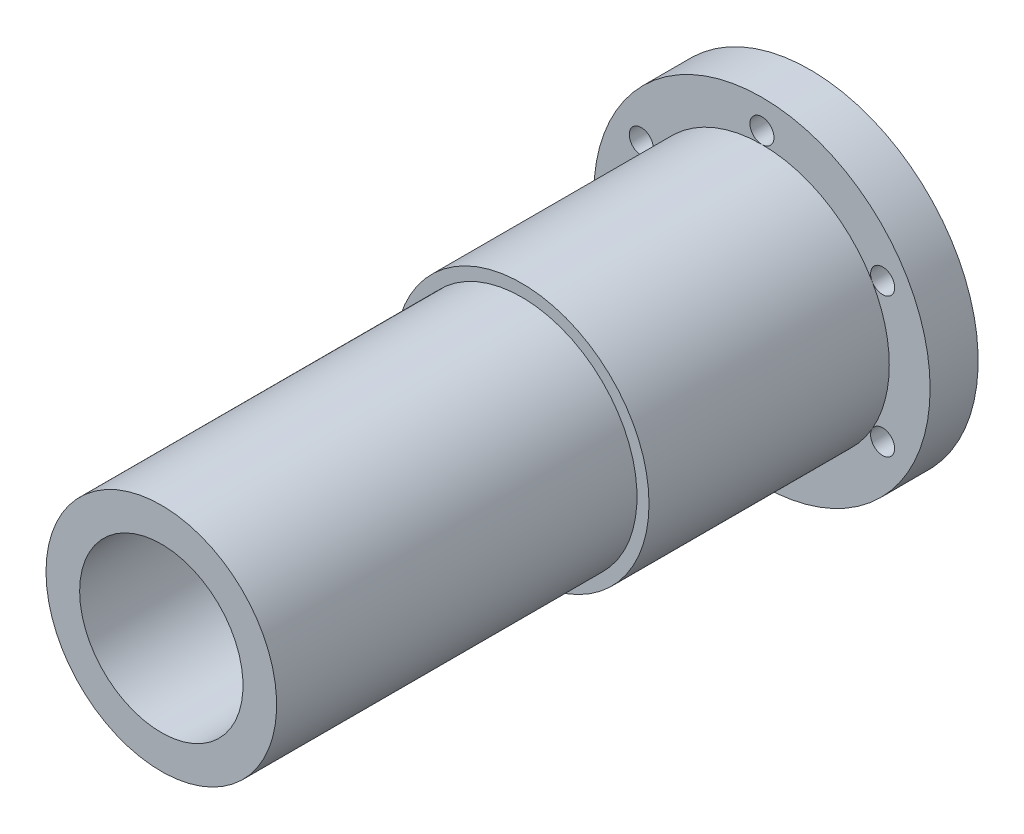
ISO-10303-21;
HEADER;
FILE_DESCRIPTION(('STEP AP214'),'2;1');
FILE_NAME('part.step','',(''),(''),'','','');
FILE_SCHEMA(('AUTOMOTIVE_DESIGN { 1 0 10303 214 1 1 1 1 }'));
ENDSEC;
DATA;
#1=APPLICATION_CONTEXT('core data for automotive mechanical design processes');
#2=APPLICATION_PROTOCOL_DEFINITION('international standard','automotive_design',2000,#1);
#3=PRODUCT_CONTEXT('',#1,'mechanical');
#4=PRODUCT('Part','Part','',(#3));
#5=PRODUCT_RELATED_PRODUCT_CATEGORY('part','',(#4));
#6=PRODUCT_DEFINITION_FORMATION('','',#4);
#7=PRODUCT_DEFINITION_CONTEXT('part definition',#1,'design');
#8=PRODUCT_DEFINITION('design','',#6,#7);
#9=PRODUCT_DEFINITION_SHAPE('','',#8);
#10=(LENGTH_UNIT() NAMED_UNIT(*) SI_UNIT(.MILLI.,.METRE.));
#11=(NAMED_UNIT(*) PLANE_ANGLE_UNIT() SI_UNIT($,.RADIAN.));
#12=(NAMED_UNIT(*) SI_UNIT($,.STERADIAN.) SOLID_ANGLE_UNIT());
#13=UNCERTAINTY_MEASURE_WITH_UNIT(LENGTH_MEASURE(1.E-05),#10,'distance_accuracy_value','');
#14=(GEOMETRIC_REPRESENTATION_CONTEXT(3) GLOBAL_UNCERTAINTY_ASSIGNED_CONTEXT((#13)) GLOBAL_UNIT_ASSIGNED_CONTEXT((#10,
#11,#12)) REPRESENTATION_CONTEXT('',''));
#15=CARTESIAN_POINT('',(0.,0.,0.));
#16=DIRECTION('',(0.,0.,1.));
#17=DIRECTION('',(1.,0.,0.));
#18=AXIS2_PLACEMENT_3D('',#15,#16,#17);
#19=CARTESIAN_POINT('',(0.,0.,0.));
#20=DIRECTION('',(0.,0.,-1.));
#21=DIRECTION('',(-1.,0.,0.));
#22=AXIS2_PLACEMENT_3D('',#19,#20,#21);
#23=CYLINDRICAL_SURFACE('',#22,17.);
#24=CARTESIAN_POINT('',(0.,0.,36.5));
#25=DIRECTION('',(0.,0.,-1.));
#26=DIRECTION('',(-1.,0.,0.));
#27=AXIS2_PLACEMENT_3D('',#24,#25,#26);
#28=CIRCLE('',#27,17.);
#29=CARTESIAN_POINT('',(-17.,0.,36.5));
#30=VERTEX_POINT('',#29);
#31=EDGE_CURVE('E91',#30,#30,#28,.T.);
#32=ORIENTED_EDGE('',*,*,#31,.T.);
#33=EDGE_LOOP('',(#32));
#34=FACE_BOUND('',#33,.T.);
#35=CARTESIAN_POINT('',(0.,0.,103.5));
#36=DIRECTION('',(0.,0.,1.));
#37=DIRECTION('',(1.,0.,0.));
#38=AXIS2_PLACEMENT_3D('',#35,#36,#37);
#39=CIRCLE('',#38,17.);
#40=CARTESIAN_POINT('',(17.,0.,103.5));
#41=VERTEX_POINT('',#40);
#42=EDGE_CURVE('E40',#41,#41,#39,.T.);
#43=ORIENTED_EDGE('',*,*,#42,.T.);
#44=EDGE_LOOP('',(#43));
#45=FACE_BOUND('',#44,.T.);
#46=ADVANCED_FACE('F36',(#34,#45),#23,.F.);
#47=CARTESIAN_POINT('',(0.,0.,109.));
#48=DIRECTION('',(0.,0.,1.));
#49=DIRECTION('',(1.,0.,0.));
#50=AXIS2_PLACEMENT_3D('',#47,#48,#49);
#51=CIRCLE('',#50,17.);
#52=CARTESIAN_POINT('',(17.,0.,109.));
#53=VERTEX_POINT('',#52);
#54=EDGE_CURVE('E149',#53,#53,#51,.T.);
#55=ORIENTED_EDGE('',*,*,#54,.F.);
#56=EDGE_LOOP('',(#55));
#57=FACE_BOUND('',#56,.T.);
#58=CARTESIAN_POINT('',(0.,0.,140.));
#59=DIRECTION('',(0.,0.,-1.));
#60=DIRECTION('',(-1.,0.,0.));
#61=AXIS2_PLACEMENT_3D('',#58,#59,#60);
#62=CIRCLE('',#61,17.);
#63=CARTESIAN_POINT('',(-17.,0.,140.));
#64=VERTEX_POINT('',#63);
#65=EDGE_CURVE('E127',#64,#64,#62,.T.);
#66=ORIENTED_EDGE('',*,*,#65,.F.);
#67=EDGE_LOOP('',(#66));
#68=FACE_BOUND('',#67,.T.);
#69=ADVANCED_FACE('F187',(#57,#68),#23,.F.);
#70=CARTESIAN_POINT('',(0.,0.,0.));
#71=DIRECTION('',(0.,0.,-1.));
#72=DIRECTION('',(-1.,0.,0.));
#73=AXIS2_PLACEMENT_3D('',#70,#71,#72);
#74=CYLINDRICAL_SURFACE('',#73,35.);
#75=CARTESIAN_POINT('',(0.,0.,5.));
#76=DIRECTION('',(0.,0.,-1.));
#77=DIRECTION('',(-1.,0.,0.));
#78=AXIS2_PLACEMENT_3D('',#75,#76,#77);
#79=CIRCLE('',#78,35.);
#80=CARTESIAN_POINT('',(-35.,0.,5.));
#81=VERTEX_POINT('',#80);
#82=EDGE_CURVE('E136',#81,#81,#79,.T.);
#83=ORIENTED_EDGE('',*,*,#82,.F.);
#84=EDGE_LOOP('',(#83));
#85=FACE_BOUND('',#84,.T.);
#86=CARTESIAN_POINT('',(0.,0.,15.));
#87=DIRECTION('',(0.,0.,1.));
#88=DIRECTION('',(1.,0.,0.));
#89=AXIS2_PLACEMENT_3D('',#86,#87,#88);
#90=CIRCLE('',#89,35.);
#91=CARTESIAN_POINT('',(35.,0.,15.));
#92=VERTEX_POINT('',#91);
#93=EDGE_CURVE('E103',#92,#92,#90,.F.);
#94=ORIENTED_EDGE('',*,*,#93,.T.);
#95=EDGE_LOOP('',(#94));
#96=FACE_BOUND('',#95,.T.);
#97=ADVANCED_FACE('F194',(#85,#96),#74,.T.);
#98=CARTESIAN_POINT('',(0.,35.,65.));
#99=DIRECTION('',(0.,0.,1.));
#100=DIRECTION('',(1.,0.,0.));
#101=AXIS2_PLACEMENT_3D('',#98,#99,#100);
#102=PLANE('',#101);
#103=CARTESIAN_POINT('',(0.,0.,65.));
#104=DIRECTION('',(0.,0.,-1.));
#105=DIRECTION('',(-1.,0.,0.));
#106=AXIS2_PLACEMENT_3D('',#103,#104,#105);
#107=CIRCLE('',#106,24.);
#108=CARTESIAN_POINT('',(-24.,0.,65.));
#109=VERTEX_POINT('',#108);
#110=EDGE_CURVE('E133',#109,#109,#107,.T.);
#111=ORIENTED_EDGE('',*,*,#110,.T.);
#112=EDGE_LOOP('',(#111));
#113=FACE_BOUND('',#112,.T.);
#114=CARTESIAN_POINT('',(0.,0.,65.));
#115=DIRECTION('',(0.,0.,1.));
#116=DIRECTION('',(1.,0.,0.));
#117=AXIS2_PLACEMENT_3D('',#114,#115,#116);
#118=CIRCLE('',#117,26.5);
#119=CARTESIAN_POINT('',(26.5,0.,65.));
#120=VERTEX_POINT('',#119);
#121=EDGE_CURVE('E88',#120,#120,#118,.T.);
#122=ORIENTED_EDGE('',*,*,#121,.T.);
#123=EDGE_LOOP('',(#122));
#124=FACE_BOUND('',#123,.T.);
#125=ADVANCED_FACE('F250',(#113,#124),#102,.T.);
#126=CARTESIAN_POINT('',(0.,29.,5.));
#127=DIRECTION('',(0.,0.,-1.));
#128=DIRECTION('',(-1.,0.,0.));
#129=AXIS2_PLACEMENT_3D('',#126,#127,#128);
#130=CYLINDRICAL_SURFACE('',#129,2.49999999999999);
#131=CARTESIAN_POINT('',(0.,29.,5.));
#132=DIRECTION('',(0.,0.,-1.));
#133=DIRECTION('',(-1.,0.,0.));
#134=AXIS2_PLACEMENT_3D('',#131,#132,#133);
#135=CIRCLE('',#134,2.49999999999999);
#136=CARTESIAN_POINT('',(-2.49999999999999,29.,5.));
#137=VERTEX_POINT('',#136);
#138=EDGE_CURVE('E121',#137,#137,#135,.T.);
#139=ORIENTED_EDGE('',*,*,#138,.T.);
#140=EDGE_LOOP('',(#139));
#141=FACE_BOUND('',#140,.T.);
#142=CARTESIAN_POINT('',(0.,29.,15.));
#143=DIRECTION('',(0.,0.,1.));
#144=DIRECTION('',(1.,0.,0.));
#145=AXIS2_PLACEMENT_3D('',#142,#143,#144);
#146=CIRCLE('',#145,2.49999999999999);
#147=CARTESIAN_POINT('',(0.,26.5,15.));
#148=VERTEX_POINT('',#147);
#149=EDGE_CURVE('E101',#148,#148,#146,.F.);
#150=ORIENTED_EDGE('',*,*,#149,.F.);
#151=EDGE_LOOP('',(#150));
#152=FACE_BOUND('',#151,.T.);
#153=ADVANCED_FACE('F247',(#141,#152),#130,.F.);
#154=CARTESIAN_POINT('',(25.1147367097488,14.4999999999999,5.));
#155=DIRECTION('',(0.,0.,-1.));
#156=DIRECTION('',(-1.,0.,0.));
#157=AXIS2_PLACEMENT_3D('',#154,#155,#156);
#158=CYLINDRICAL_SURFACE('',#157,2.49999999999999);
#159=CARTESIAN_POINT('',(25.1147367097488,14.4999999999999,5.));
#160=DIRECTION('',(0.,0.,-1.));
#161=DIRECTION('',(-1.,0.,0.));
#162=AXIS2_PLACEMENT_3D('',#159,#160,#161);
#163=CIRCLE('',#162,2.49999999999999);
#164=CARTESIAN_POINT('',(22.6147367097488,14.4999999999999,5.));
#165=VERTEX_POINT('',#164);
#166=EDGE_CURVE('E118',#165,#165,#163,.T.);
#167=ORIENTED_EDGE('',*,*,#166,.T.);
#168=EDGE_LOOP('',(#167));
#169=FACE_BOUND('',#168,.T.);
#170=CARTESIAN_POINT('',(25.1147367097488,14.4999999999999,15.));
#171=DIRECTION('',(0.,0.,1.));
#172=DIRECTION('',(1.,0.,0.));
#173=AXIS2_PLACEMENT_3D('',#170,#171,#172);
#174=CIRCLE('',#173,2.49999999999999);
#175=CARTESIAN_POINT('',(22.9496732002877,13.2499999999999,15.));
#176=VERTEX_POINT('',#175);
#177=EDGE_CURVE('E99',#176,#176,#174,.F.);
#178=ORIENTED_EDGE('',*,*,#177,.F.);
#179=EDGE_LOOP('',(#178));
#180=FACE_BOUND('',#179,.T.);
#181=ADVANCED_FACE('F244',(#169,#180),#158,.F.);
#182=CARTESIAN_POINT('',(25.1147367097487,-14.5000000000001,5.));
#183=DIRECTION('',(0.,0.,-1.));
#184=DIRECTION('',(-1.,0.,0.));
#185=AXIS2_PLACEMENT_3D('',#182,#183,#184);
#186=CYLINDRICAL_SURFACE('',#185,2.49999999999999);
#187=CARTESIAN_POINT('',(25.1147367097487,-14.5000000000001,5.));
#188=DIRECTION('',(0.,0.,-1.));
#189=DIRECTION('',(-1.,0.,0.));
#190=AXIS2_PLACEMENT_3D('',#187,#188,#189);
#191=CIRCLE('',#190,2.49999999999999);
#192=CARTESIAN_POINT('',(22.6147367097487,-14.5000000000001,5.));
#193=VERTEX_POINT('',#192);
#194=EDGE_CURVE('E115',#193,#193,#191,.T.);
#195=ORIENTED_EDGE('',*,*,#194,.T.);
#196=EDGE_LOOP('',(#195));
#197=FACE_BOUND('',#196,.T.);
#198=CARTESIAN_POINT('',(25.1147367097487,-14.5000000000001,15.));
#199=DIRECTION('',(0.,0.,1.));
#200=DIRECTION('',(1.,0.,0.));
#201=AXIS2_PLACEMENT_3D('',#198,#199,#200);
#202=CIRCLE('',#201,2.49999999999999);
#203=CARTESIAN_POINT('',(22.9496732002876,-13.2500000000001,15.));
#204=VERTEX_POINT('',#203);
#205=EDGE_CURVE('E96',#204,#204,#202,.F.);
#206=ORIENTED_EDGE('',*,*,#205,.F.);
#207=EDGE_LOOP('',(#206));
#208=FACE_BOUND('',#207,.T.);
#209=ADVANCED_FACE('F240',(#197,#208),#186,.F.);
#210=CARTESIAN_POINT('',(0.,-29.,5.));
#211=DIRECTION('',(0.,0.,-1.));
#212=DIRECTION('',(-1.,0.,0.));
#213=AXIS2_PLACEMENT_3D('',#210,#211,#212);
#214=CYLINDRICAL_SURFACE('',#213,2.49999999999999);
#215=CARTESIAN_POINT('',(0.,-29.,5.));
#216=DIRECTION('',(0.,0.,-1.));
#217=DIRECTION('',(-1.,0.,0.));
#218=AXIS2_PLACEMENT_3D('',#215,#216,#217);
#219=CIRCLE('',#218,2.49999999999999);
#220=CARTESIAN_POINT('',(-2.49999999999999,-29.,5.));
#221=VERTEX_POINT('',#220);
#222=EDGE_CURVE('E112',#221,#221,#219,.T.);
#223=ORIENTED_EDGE('',*,*,#222,.T.);
#224=EDGE_LOOP('',(#223));
#225=FACE_BOUND('',#224,.T.);
#226=CARTESIAN_POINT('',(0.,-29.,15.));
#227=DIRECTION('',(0.,0.,1.));
#228=DIRECTION('',(1.,0.,0.));
#229=AXIS2_PLACEMENT_3D('',#226,#227,#228);
#230=CIRCLE('',#229,2.49999999999999);
#231=CARTESIAN_POINT('',(0.,-26.5,15.));
#232=VERTEX_POINT('',#231);
#233=EDGE_CURVE('E93',#232,#232,#230,.F.);
#234=ORIENTED_EDGE('',*,*,#233,.F.);
#235=EDGE_LOOP('',(#234));
#236=FACE_BOUND('',#235,.T.);
#237=ADVANCED_FACE('F232',(#225,#236),#214,.F.);
#238=CARTESIAN_POINT('',(-25.1147367097489,-14.4999999999998,5.));
#239=DIRECTION('',(0.,0.,-1.));
#240=DIRECTION('',(-1.,0.,0.));
#241=AXIS2_PLACEMENT_3D('',#238,#239,#240);
#242=CYLINDRICAL_SURFACE('',#241,2.49999999999999);
#243=CARTESIAN_POINT('',(-25.1147367097489,-14.4999999999998,5.));
#244=DIRECTION('',(0.,0.,-1.));
#245=DIRECTION('',(-1.,0.,0.));
#246=AXIS2_PLACEMENT_3D('',#243,#244,#245);
#247=CIRCLE('',#246,2.49999999999999);
#248=CARTESIAN_POINT('',(-27.6147367097488,-14.4999999999998,5.));
#249=VERTEX_POINT('',#248);
#250=EDGE_CURVE('E109',#249,#249,#247,.T.);
#251=ORIENTED_EDGE('',*,*,#250,.T.);
#252=EDGE_LOOP('',(#251));
#253=FACE_BOUND('',#252,.T.);
#254=CARTESIAN_POINT('',(-25.1147367097489,-14.4999999999998,15.));
#255=DIRECTION('',(0.,0.,1.));
#256=DIRECTION('',(1.,0.,0.));
#257=AXIS2_PLACEMENT_3D('',#254,#255,#256);
#258=CIRCLE('',#257,2.49999999999999);
#259=CARTESIAN_POINT('',(-22.9496732002878,-13.2499999999998,15.));
#260=VERTEX_POINT('',#259);
#261=EDGE_CURVE('E80',#260,#260,#258,.F.);
#262=ORIENTED_EDGE('',*,*,#261,.F.);
#263=EDGE_LOOP('',(#262));
#264=FACE_BOUND('',#263,.T.);
#265=ADVANCED_FACE('F224',(#253,#264),#242,.F.);
#266=CARTESIAN_POINT('',(-25.1147367097486,14.5000000000003,5.));
#267=DIRECTION('',(0.,0.,-1.));
#268=DIRECTION('',(-1.,0.,0.));
#269=AXIS2_PLACEMENT_3D('',#266,#267,#268);
#270=CYLINDRICAL_SURFACE('',#269,2.49999999999999);
#271=CARTESIAN_POINT('',(-25.1147367097486,14.5000000000003,5.));
#272=DIRECTION('',(0.,0.,-1.));
#273=DIRECTION('',(-1.,0.,0.));
#274=AXIS2_PLACEMENT_3D('',#271,#272,#273);
#275=CIRCLE('',#274,2.49999999999999);
#276=CARTESIAN_POINT('',(-27.6147367097485,14.5000000000003,5.));
#277=VERTEX_POINT('',#276);
#278=EDGE_CURVE('E106',#277,#277,#275,.T.);
#279=ORIENTED_EDGE('',*,*,#278,.T.);
#280=EDGE_LOOP('',(#279));
#281=FACE_BOUND('',#280,.T.);
#282=CARTESIAN_POINT('',(-25.1147367097486,14.5000000000003,15.));
#283=DIRECTION('',(0.,0.,1.));
#284=DIRECTION('',(1.,0.,0.));
#285=AXIS2_PLACEMENT_3D('',#282,#283,#284);
#286=CIRCLE('',#285,2.49999999999999);
#287=CARTESIAN_POINT('',(-22.9496732002875,13.2500000000003,15.));
#288=VERTEX_POINT('',#287);
#289=EDGE_CURVE('E11',#288,#288,#286,.F.);
#290=ORIENTED_EDGE('',*,*,#289,.F.);
#291=EDGE_LOOP('',(#290));
#292=FACE_BOUND('',#291,.T.);
#293=ADVANCED_FACE('F216',(#281,#292),#270,.F.);
#294=CARTESIAN_POINT('',(0.,17.,0.));
#295=DIRECTION('',(0.,0.,-1.));
#296=DIRECTION('',(-1.,0.,0.));
#297=AXIS2_PLACEMENT_3D('',#294,#295,#296);
#298=PLANE('',#297);
#299=CARTESIAN_POINT('',(0.,0.,0.));
#300=DIRECTION('',(0.,0.,-1.));
#301=DIRECTION('',(-1.,0.,0.));
#302=AXIS2_PLACEMENT_3D('',#299,#300,#301);
#303=CIRCLE('',#302,24.);
#304=CARTESIAN_POINT('',(-24.,0.,0.));
#305=VERTEX_POINT('',#304);
#306=EDGE_CURVE('E45',#305,#305,#303,.T.);
#307=ORIENTED_EDGE('',*,*,#306,.T.);
#308=EDGE_LOOP('',(#307));
#309=FACE_BOUND('',#308,.T.);
#310=CARTESIAN_POINT('',(0.,0.,0.));
#311=DIRECTION('',(0.,0.,-1.));
#312=DIRECTION('',(-1.,0.,0.));
#313=AXIS2_PLACEMENT_3D('',#310,#311,#312);
#314=CIRCLE('',#313,17.);
#315=CARTESIAN_POINT('',(-17.,0.,0.));
#316=VERTEX_POINT('',#315);
#317=EDGE_CURVE('E124',#316,#316,#314,.T.);
#318=ORIENTED_EDGE('',*,*,#317,.F.);
#319=EDGE_LOOP('',(#318));
#320=FACE_BOUND('',#319,.T.);
#321=ADVANCED_FACE('F38',(#309,#320),#298,.T.);
#322=CARTESIAN_POINT('',(0.,0.,0.));
#323=DIRECTION('',(0.,0.,-1.));
#324=DIRECTION('',(-1.,0.,0.));
#325=AXIS2_PLACEMENT_3D('',#322,#323,#324);
#326=CYLINDRICAL_SURFACE('',#325,24.);
#327=CARTESIAN_POINT('',(0.,0.,5.));
#328=DIRECTION('',(0.,0.,-1.));
#329=DIRECTION('',(-1.,0.,0.));
#330=AXIS2_PLACEMENT_3D('',#327,#328,#329);
#331=CIRCLE('',#330,24.);
#332=CARTESIAN_POINT('',(-24.,0.,5.));
#333=VERTEX_POINT('',#332);
#334=EDGE_CURVE('E139',#333,#333,#331,.T.);
#335=ORIENTED_EDGE('',*,*,#334,.T.);
#336=EDGE_LOOP('',(#335));
#337=FACE_BOUND('',#336,.T.);
#338=ORIENTED_EDGE('',*,*,#306,.F.);
#339=EDGE_LOOP('',(#338));
#340=FACE_BOUND('',#339,.T.);
#341=ADVANCED_FACE('F215',(#337,#340),#326,.T.);
#342=CARTESIAN_POINT('',(0.,24.,5.));
#343=DIRECTION('',(0.,0.,-1.));
#344=DIRECTION('',(-1.,0.,0.));
#345=AXIS2_PLACEMENT_3D('',#342,#343,#344);
#346=PLANE('',#345);
#347=ORIENTED_EDGE('',*,*,#278,.F.);
#348=EDGE_LOOP('',(#347));
#349=FACE_BOUND('',#348,.T.);
#350=ORIENTED_EDGE('',*,*,#250,.F.);
#351=EDGE_LOOP('',(#350));
#352=FACE_BOUND('',#351,.T.);
#353=ORIENTED_EDGE('',*,*,#222,.F.);
#354=EDGE_LOOP('',(#353));
#355=FACE_BOUND('',#354,.T.);
#356=ORIENTED_EDGE('',*,*,#194,.F.);
#357=EDGE_LOOP('',(#356));
#358=FACE_BOUND('',#357,.T.);
#359=ORIENTED_EDGE('',*,*,#166,.F.);
#360=EDGE_LOOP('',(#359));
#361=FACE_BOUND('',#360,.T.);
#362=ORIENTED_EDGE('',*,*,#138,.F.);
#363=EDGE_LOOP('',(#362));
#364=FACE_BOUND('',#363,.T.);
#365=ORIENTED_EDGE('',*,*,#82,.T.);
#366=EDGE_LOOP('',(#365));
#367=FACE_BOUND('',#366,.T.);
#368=ORIENTED_EDGE('',*,*,#334,.F.);
#369=EDGE_LOOP('',(#368));
#370=FACE_BOUND('',#369,.T.);
#371=ADVANCED_FACE('F222',(#349,#352,#355,#358,#361,#364,#367,#370),#346,.T.);
#372=CARTESIAN_POINT('',(0.,0.,0.));
#373=DIRECTION('',(0.,0.,-1.));
#374=DIRECTION('',(-1.,0.,0.));
#375=AXIS2_PLACEMENT_3D('',#372,#373,#374);
#376=CYLINDRICAL_SURFACE('',#375,24.);
#377=CARTESIAN_POINT('',(0.,0.,140.));
#378=DIRECTION('',(0.,0.,-1.));
#379=DIRECTION('',(-1.,0.,0.));
#380=AXIS2_PLACEMENT_3D('',#377,#378,#379);
#381=CIRCLE('',#380,24.);
#382=CARTESIAN_POINT('',(-24.,0.,140.));
#383=VERTEX_POINT('',#382);
#384=EDGE_CURVE('E130',#383,#383,#381,.T.);
#385=ORIENTED_EDGE('',*,*,#384,.T.);
#386=EDGE_LOOP('',(#385));
#387=FACE_BOUND('',#386,.T.);
#388=ORIENTED_EDGE('',*,*,#110,.F.);
#389=EDGE_LOOP('',(#388));
#390=FACE_BOUND('',#389,.T.);
#391=ADVANCED_FACE('F208',(#387,#390),#376,.T.);
#392=CARTESIAN_POINT('',(0.,24.,140.));
#393=DIRECTION('',(0.,0.,1.));
#394=DIRECTION('',(1.,0.,0.));
#395=AXIS2_PLACEMENT_3D('',#392,#393,#394);
#396=PLANE('',#395);
#397=ORIENTED_EDGE('',*,*,#65,.T.);
#398=EDGE_LOOP('',(#397));
#399=FACE_BOUND('',#398,.T.);
#400=ORIENTED_EDGE('',*,*,#384,.F.);
#401=EDGE_LOOP('',(#400));
#402=FACE_BOUND('',#401,.T.);
#403=ADVANCED_FACE('F200',(#399,#402),#396,.T.);
#404=CARTESIAN_POINT('',(0.,0.,31.));
#405=DIRECTION('',(0.,0.,-1.));
#406=DIRECTION('',(-1.,0.,0.));
#407=AXIS2_PLACEMENT_3D('',#404,#405,#406);
#408=CIRCLE('',#407,17.);
#409=CARTESIAN_POINT('',(-17.,0.,31.));
#410=VERTEX_POINT('',#409);
#411=EDGE_CURVE('E144',#410,#410,#408,.T.);
#412=ORIENTED_EDGE('',*,*,#411,.F.);
#413=EDGE_LOOP('',(#412));
#414=FACE_BOUND('',#413,.T.);
#415=ORIENTED_EDGE('',*,*,#317,.T.);
#416=EDGE_LOOP('',(#415));
#417=FACE_BOUND('',#416,.T.);
#418=ADVANCED_FACE('F190',(#414,#417),#23,.F.);
#419=CARTESIAN_POINT('',(0.,0.,15.));
#420=DIRECTION('',(0.,0.,1.));
#421=DIRECTION('',(1.,0.,0.));
#422=AXIS2_PLACEMENT_3D('',#419,#420,#421);
#423=PLANE('',#422);
#424=ORIENTED_EDGE('',*,*,#93,.F.);
#425=EDGE_LOOP('',(#424));
#426=FACE_BOUND('',#425,.T.);
#427=CARTESIAN_POINT('',(0.,0.,15.));
#428=DIRECTION('',(0.,0.,1.));
#429=DIRECTION('',(1.,0.,0.));
#430=AXIS2_PLACEMENT_3D('',#427,#428,#429);
#431=CIRCLE('',#430,26.5);
#432=EDGE_CURVE('E53',#176,#148,#431,.T.);
#433=ORIENTED_EDGE('',*,*,#432,.F.);
#434=ORIENTED_EDGE('',*,*,#177,.T.);
#435=EDGE_CURVE('E85',#204,#176,#431,.T.);
#436=ORIENTED_EDGE('',*,*,#435,.F.);
#437=ORIENTED_EDGE('',*,*,#205,.T.);
#438=EDGE_CURVE('E82',#232,#204,#431,.T.);
#439=ORIENTED_EDGE('',*,*,#438,.F.);
#440=ORIENTED_EDGE('',*,*,#233,.T.);
#441=EDGE_CURVE('E81',#260,#232,#431,.T.);
#442=ORIENTED_EDGE('',*,*,#441,.F.);
#443=ORIENTED_EDGE('',*,*,#261,.T.);
#444=EDGE_CURVE('E73',#288,#260,#431,.T.);
#445=ORIENTED_EDGE('',*,*,#444,.F.);
#446=ORIENTED_EDGE('',*,*,#289,.T.);
#447=EDGE_CURVE('E69',#148,#288,#431,.T.);
#448=ORIENTED_EDGE('',*,*,#447,.F.);
#449=ORIENTED_EDGE('',*,*,#149,.T.);
#450=EDGE_LOOP('',(#433,#434,#436,#437,#439,#440,#442,#443,#445,#446,#448,#449));
#451=FACE_BOUND('',#450,.T.);
#452=ADVANCED_FACE('F77',(#426,#451),#423,.T.);
#453=CARTESIAN_POINT('',(0.,0.,15.));
#454=DIRECTION('',(0.,0.,1.));
#455=DIRECTION('',(1.,0.,0.));
#456=AXIS2_PLACEMENT_3D('',#453,#454,#455);
#457=CYLINDRICAL_SURFACE('',#456,26.5);
#458=ORIENTED_EDGE('',*,*,#432,.T.);
#459=ORIENTED_EDGE('',*,*,#447,.T.);
#460=ORIENTED_EDGE('',*,*,#444,.T.);
#461=ORIENTED_EDGE('',*,*,#441,.T.);
#462=ORIENTED_EDGE('',*,*,#438,.T.);
#463=ORIENTED_EDGE('',*,*,#435,.T.);
#464=EDGE_LOOP('',(#458,#459,#460,#461,#462,#463));
#465=FACE_BOUND('',#464,.T.);
#466=ORIENTED_EDGE('',*,*,#121,.F.);
#467=EDGE_LOOP('',(#466));
#468=FACE_BOUND('',#467,.T.);
#469=ADVANCED_FACE('F71',(#465,#468),#457,.T.);
#470=CARTESIAN_POINT('',(0.,0.,36.5));
#471=DIRECTION('',(0.,0.,-1.));
#472=DIRECTION('',(-1.,0.,0.));
#473=AXIS2_PLACEMENT_3D('',#470,#471,#472);
#474=CYLINDRICAL_SURFACE('',#473,18.5);
#475=CARTESIAN_POINT('',(0.,0.,36.5));
#476=DIRECTION('',(0.,0.,-1.));
#477=DIRECTION('',(-1.,0.,0.));
#478=AXIS2_PLACEMENT_3D('',#475,#476,#477);
#479=CIRCLE('',#478,18.5);
#480=CARTESIAN_POINT('',(-18.5,0.,36.5));
#481=VERTEX_POINT('',#480);
#482=EDGE_CURVE('E147',#481,#481,#479,.T.);
#483=ORIENTED_EDGE('',*,*,#482,.F.);
#484=EDGE_LOOP('',(#483));
#485=FACE_BOUND('',#484,.T.);
#486=CARTESIAN_POINT('',(0.,0.,31.));
#487=DIRECTION('',(0.,0.,-1.));
#488=DIRECTION('',(-1.,0.,0.));
#489=AXIS2_PLACEMENT_3D('',#486,#487,#488);
#490=CIRCLE('',#489,18.5);
#491=CARTESIAN_POINT('',(-18.5,0.,31.));
#492=VERTEX_POINT('',#491);
#493=EDGE_CURVE('E86',#492,#492,#490,.T.);
#494=ORIENTED_EDGE('',*,*,#493,.T.);
#495=EDGE_LOOP('',(#494));
#496=FACE_BOUND('',#495,.T.);
#497=ADVANCED_FACE('F168',(#485,#496),#474,.F.);
#498=CARTESIAN_POINT('',(0.,0.,36.5));
#499=DIRECTION('',(0.,0.,-1.));
#500=DIRECTION('',(-1.,0.,0.));
#501=AXIS2_PLACEMENT_3D('',#498,#499,#500);
#502=PLANE('',#501);
#503=ORIENTED_EDGE('',*,*,#31,.F.);
#504=EDGE_LOOP('',(#503));
#505=FACE_BOUND('',#504,.T.);
#506=ORIENTED_EDGE('',*,*,#482,.T.);
#507=EDGE_LOOP('',(#506));
#508=FACE_BOUND('',#507,.T.);
#509=ADVANCED_FACE('F173',(#505,#508),#502,.T.);
#510=CARTESIAN_POINT('',(0.,0.,31.));
#511=DIRECTION('',(0.,0.,-1.));
#512=DIRECTION('',(-1.,0.,0.));
#513=AXIS2_PLACEMENT_3D('',#510,#511,#512);
#514=PLANE('',#513);
#515=ORIENTED_EDGE('',*,*,#411,.T.);
#516=EDGE_LOOP('',(#515));
#517=FACE_BOUND('',#516,.T.);
#518=ORIENTED_EDGE('',*,*,#493,.F.);
#519=EDGE_LOOP('',(#518));
#520=FACE_BOUND('',#519,.T.);
#521=ADVANCED_FACE('F170',(#517,#520),#514,.F.);
#522=CARTESIAN_POINT('',(0.,0.,103.5));
#523=DIRECTION('',(0.,0.,1.));
#524=DIRECTION('',(1.,0.,0.));
#525=AXIS2_PLACEMENT_3D('',#522,#523,#524);
#526=CYLINDRICAL_SURFACE('',#525,18.5);
#527=CARTESIAN_POINT('',(0.,0.,103.5));
#528=DIRECTION('',(0.,0.,1.));
#529=DIRECTION('',(1.,0.,0.));
#530=AXIS2_PLACEMENT_3D('',#527,#528,#529);
#531=CIRCLE('',#530,18.5);
#532=CARTESIAN_POINT('',(18.5,0.,103.5));
#533=VERTEX_POINT('',#532);
#534=EDGE_CURVE('E151',#533,#533,#531,.T.);
#535=ORIENTED_EDGE('',*,*,#534,.F.);
#536=EDGE_LOOP('',(#535));
#537=FACE_BOUND('',#536,.T.);
#538=CARTESIAN_POINT('',(0.,0.,109.));
#539=DIRECTION('',(0.,0.,1.));
#540=DIRECTION('',(1.,0.,0.));
#541=AXIS2_PLACEMENT_3D('',#538,#539,#540);
#542=CIRCLE('',#541,18.5);
#543=CARTESIAN_POINT('',(18.5,0.,109.));
#544=VERTEX_POINT('',#543);
#545=EDGE_CURVE('E156',#544,#544,#542,.T.);
#546=ORIENTED_EDGE('',*,*,#545,.T.);
#547=EDGE_LOOP('',(#546));
#548=FACE_BOUND('',#547,.T.);
#549=ADVANCED_FACE('F172',(#537,#548),#526,.F.);
#550=CARTESIAN_POINT('',(0.,0.,103.5));
#551=DIRECTION('',(0.,0.,1.));
#552=DIRECTION('',(1.,0.,0.));
#553=AXIS2_PLACEMENT_3D('',#550,#551,#552);
#554=PLANE('',#553);
#555=ORIENTED_EDGE('',*,*,#42,.F.);
#556=EDGE_LOOP('',(#555));
#557=FACE_BOUND('',#556,.T.);
#558=ORIENTED_EDGE('',*,*,#534,.T.);
#559=EDGE_LOOP('',(#558));
#560=FACE_BOUND('',#559,.T.);
#561=ADVANCED_FACE('F180',(#557,#560),#554,.T.);
#562=CARTESIAN_POINT('',(0.,0.,109.));
#563=DIRECTION('',(0.,0.,1.));
#564=DIRECTION('',(1.,0.,0.));
#565=AXIS2_PLACEMENT_3D('',#562,#563,#564);
#566=PLANE('',#565);
#567=ORIENTED_EDGE('',*,*,#54,.T.);
#568=EDGE_LOOP('',(#567));
#569=FACE_BOUND('',#568,.T.);
#570=ORIENTED_EDGE('',*,*,#545,.F.);
#571=EDGE_LOOP('',(#570));
#572=FACE_BOUND('',#571,.T.);
#573=ADVANCED_FACE('F318',(#569,#572),#566,.F.);
#574=CLOSED_SHELL('',(#46,#69,#97,#125,#153,#181,#209,#237,#265,#293,#321,#341,#371,#391,#403,
#418,#452,#469,#497,#509,#521,#549,#561,#573));
#575=MANIFOLD_SOLID_BREP('B2',#574);
#576=ADVANCED_BREP_SHAPE_REPRESENTATION('',(#18,#575),#14);
#577=SHAPE_DEFINITION_REPRESENTATION(#9,#576);
ENDSEC;
END-ISO-10303-21;
